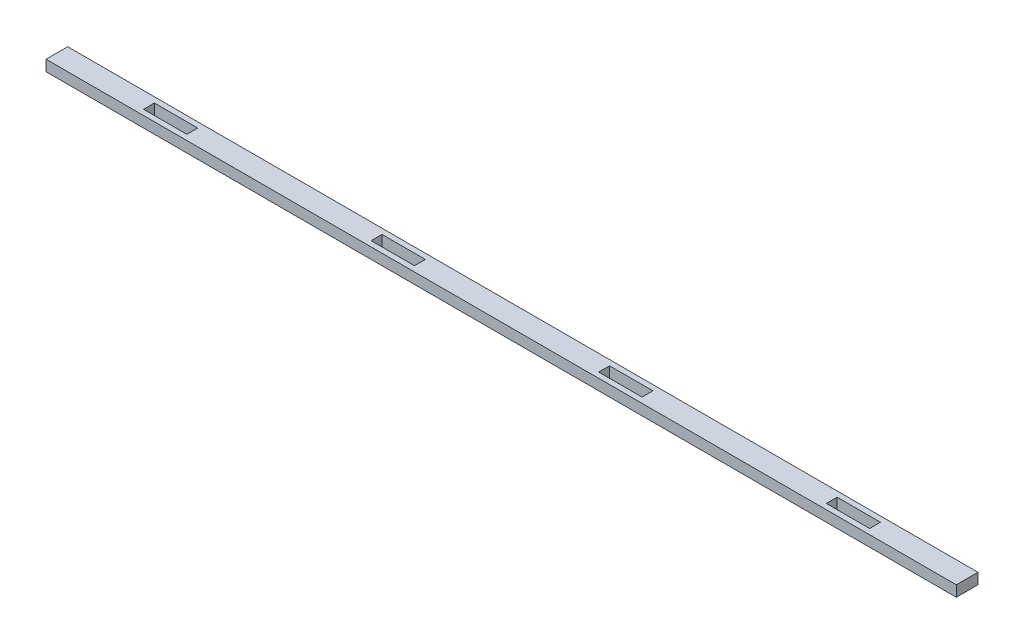
ISO-10303-21;
HEADER;
FILE_DESCRIPTION(('STEP AP214'),'2;1');
FILE_NAME('part.step','',(''),(''),'','','');
FILE_SCHEMA(('AUTOMOTIVE_DESIGN { 1 0 10303 214 1 1 1 1 }'));
ENDSEC;
DATA;
#1=APPLICATION_CONTEXT('core data for automotive mechanical design processes');
#2=APPLICATION_PROTOCOL_DEFINITION('international standard','automotive_design',2000,#1);
#3=PRODUCT_CONTEXT('',#1,'mechanical');
#4=PRODUCT('Part','Part','',(#3));
#5=PRODUCT_RELATED_PRODUCT_CATEGORY('part','',(#4));
#6=PRODUCT_DEFINITION_FORMATION('','',#4);
#7=PRODUCT_DEFINITION_CONTEXT('part definition',#1,'design');
#8=PRODUCT_DEFINITION('design','',#6,#7);
#9=PRODUCT_DEFINITION_SHAPE('','',#8);
#10=(LENGTH_UNIT() NAMED_UNIT(*) SI_UNIT(.MILLI.,.METRE.));
#11=(NAMED_UNIT(*) PLANE_ANGLE_UNIT() SI_UNIT($,.RADIAN.));
#12=(NAMED_UNIT(*) SI_UNIT($,.STERADIAN.) SOLID_ANGLE_UNIT());
#13=UNCERTAINTY_MEASURE_WITH_UNIT(LENGTH_MEASURE(1.E-05),#10,'distance_accuracy_value','');
#14=(GEOMETRIC_REPRESENTATION_CONTEXT(3) GLOBAL_UNCERTAINTY_ASSIGNED_CONTEXT((#13)) GLOBAL_UNIT_ASSIGNED_CONTEXT((#10,
#11,#12)) REPRESENTATION_CONTEXT('',''));
#15=CARTESIAN_POINT('',(0.,0.,0.));
#16=DIRECTION('',(0.,0.,1.));
#17=DIRECTION('',(1.,0.,0.));
#18=AXIS2_PLACEMENT_3D('',#15,#16,#17);
#19=CARTESIAN_POINT('',(187.325,0.,-3.175));
#20=DIRECTION('',(0.,0.,-1.));
#21=DIRECTION('',(-1.,0.,0.));
#22=AXIS2_PLACEMENT_3D('',#19,#20,#21);
#23=PLANE('',#22);
#24=DIRECTION('',(-1.,0.,0.));
#25=VECTOR('',#24,1.);
#26=CARTESIAN_POINT('',(187.325,6.35,-3.175));
#27=LINE('',#26,#25);
#28=CARTESIAN_POINT('',(212.725,6.35,-3.175));
#29=VERTEX_POINT('',#28);
#30=CARTESIAN_POINT('',(187.325,6.35,-3.175));
#31=VERTEX_POINT('',#30);
#32=EDGE_CURVE('E316',#29,#31,#27,.T.);
#33=ORIENTED_EDGE('',*,*,#32,.T.);
#34=DIRECTION('',(0.,1.,0.));
#35=VECTOR('',#34,1.);
#36=CARTESIAN_POINT('',(187.325,0.,-3.175));
#37=LINE('',#36,#35);
#38=CARTESIAN_POINT('',(187.325,0.,-3.175));
#39=VERTEX_POINT('',#38);
#40=EDGE_CURVE('E11',#39,#31,#37,.T.);
#41=ORIENTED_EDGE('',*,*,#40,.F.);
#42=DIRECTION('',(-1.,0.,0.));
#43=VECTOR('',#42,1.);
#44=CARTESIAN_POINT('',(187.325,0.,-3.175));
#45=LINE('',#44,#43);
#46=CARTESIAN_POINT('',(212.725,0.,-3.175));
#47=VERTEX_POINT('',#46);
#48=EDGE_CURVE('E320',#47,#39,#45,.T.);
#49=ORIENTED_EDGE('',*,*,#48,.F.);
#50=DIRECTION('',(0.,1.,0.));
#51=VECTOR('',#50,1.);
#52=CARTESIAN_POINT('',(212.725,0.,-3.175));
#53=LINE('',#52,#51);
#54=EDGE_CURVE('E325',#47,#29,#53,.T.);
#55=ORIENTED_EDGE('',*,*,#54,.T.);
#56=EDGE_LOOP('',(#33,#41,#49,#55));
#57=FACE_BOUND('',#56,.T.);
#58=ADVANCED_FACE('F35',(#57),#23,.F.);
#59=CARTESIAN_POINT('',(187.325,0.,-3.175));
#60=DIRECTION('',(-1.,0.,0.));
#61=DIRECTION('',(0.,0.,1.));
#62=AXIS2_PLACEMENT_3D('',#59,#60,#61);
#63=PLANE('',#62);
#64=DIRECTION('',(0.,0.,1.));
#65=VECTOR('',#64,1.);
#66=CARTESIAN_POINT('',(187.325,6.35,-3.175));
#67=LINE('',#66,#65);
#68=CARTESIAN_POINT('',(187.325,6.35,3.175));
#69=VERTEX_POINT('',#68);
#70=EDGE_CURVE('E313',#31,#69,#67,.T.);
#71=ORIENTED_EDGE('',*,*,#70,.T.);
#72=DIRECTION('',(0.,1.,0.));
#73=VECTOR('',#72,1.);
#74=CARTESIAN_POINT('',(187.325,0.,3.175));
#75=LINE('',#74,#73);
#76=CARTESIAN_POINT('',(187.325,0.,3.175));
#77=VERTEX_POINT('',#76);
#78=EDGE_CURVE('E42',#77,#69,#75,.T.);
#79=ORIENTED_EDGE('',*,*,#78,.F.);
#80=DIRECTION('',(0.,0.,1.));
#81=VECTOR('',#80,1.);
#82=CARTESIAN_POINT('',(187.325,0.,-3.175));
#83=LINE('',#82,#81);
#84=EDGE_CURVE('E56',#39,#77,#83,.T.);
#85=ORIENTED_EDGE('',*,*,#84,.F.);
#86=ORIENTED_EDGE('',*,*,#40,.T.);
#87=EDGE_LOOP('',(#71,#79,#85,#86));
#88=FACE_BOUND('',#87,.T.);
#89=ADVANCED_FACE('F335',(#88),#63,.F.);
#90=CARTESIAN_POINT('',(187.325,0.,3.175));
#91=DIRECTION('',(0.,0.,1.));
#92=DIRECTION('',(1.,0.,0.));
#93=AXIS2_PLACEMENT_3D('',#90,#91,#92);
#94=PLANE('',#93);
#95=DIRECTION('',(1.,0.,0.));
#96=VECTOR('',#95,1.);
#97=CARTESIAN_POINT('',(187.325,6.35,3.175));
#98=LINE('',#97,#96);
#99=CARTESIAN_POINT('',(212.725,6.35,3.175));
#100=VERTEX_POINT('',#99);
#101=EDGE_CURVE('E310',#69,#100,#98,.T.);
#102=ORIENTED_EDGE('',*,*,#101,.T.);
#103=DIRECTION('',(0.,1.,0.));
#104=VECTOR('',#103,1.);
#105=CARTESIAN_POINT('',(212.725,0.,3.175));
#106=LINE('',#105,#104);
#107=CARTESIAN_POINT('',(212.725,0.,3.175));
#108=VERTEX_POINT('',#107);
#109=EDGE_CURVE('E328',#108,#100,#106,.T.);
#110=ORIENTED_EDGE('',*,*,#109,.F.);
#111=DIRECTION('',(1.,0.,0.));
#112=VECTOR('',#111,1.);
#113=CARTESIAN_POINT('',(187.325,0.,3.175));
#114=LINE('',#113,#112);
#115=EDGE_CURVE('E323',#77,#108,#114,.T.);
#116=ORIENTED_EDGE('',*,*,#115,.F.);
#117=ORIENTED_EDGE('',*,*,#78,.T.);
#118=EDGE_LOOP('',(#102,#110,#116,#117));
#119=FACE_BOUND('',#118,.T.);
#120=ADVANCED_FACE('F332',(#119),#94,.F.);
#121=CARTESIAN_POINT('',(212.725,0.,-3.175));
#122=DIRECTION('',(1.,0.,0.));
#123=DIRECTION('',(0.,0.,-1.));
#124=AXIS2_PLACEMENT_3D('',#121,#122,#123);
#125=PLANE('',#124);
#126=DIRECTION('',(0.,0.,-1.));
#127=VECTOR('',#126,1.);
#128=CARTESIAN_POINT('',(212.725,6.35,-3.175));
#129=LINE('',#128,#127);
#130=EDGE_CURVE('E308',#100,#29,#129,.T.);
#131=ORIENTED_EDGE('',*,*,#130,.T.);
#132=ORIENTED_EDGE('',*,*,#54,.F.);
#133=DIRECTION('',(0.,0.,-1.));
#134=VECTOR('',#133,1.);
#135=CARTESIAN_POINT('',(212.725,0.,-3.175));
#136=LINE('',#135,#134);
#137=EDGE_CURVE('E49',#108,#47,#136,.T.);
#138=ORIENTED_EDGE('',*,*,#137,.F.);
#139=ORIENTED_EDGE('',*,*,#109,.T.);
#140=EDGE_LOOP('',(#131,#132,#138,#139));
#141=FACE_BOUND('',#140,.T.);
#142=ADVANCED_FACE('F341',(#141),#125,.F.);
#143=CARTESIAN_POINT('',(53.9750000000001,0.,-3.175));
#144=DIRECTION('',(0.,0.,-1.));
#145=DIRECTION('',(-1.,0.,0.));
#146=AXIS2_PLACEMENT_3D('',#143,#144,#145);
#147=PLANE('',#146);
#148=DIRECTION('',(-1.,0.,0.));
#149=VECTOR('',#148,1.);
#150=CARTESIAN_POINT('',(53.9750000000001,6.35,-3.175));
#151=LINE('',#150,#149);
#152=CARTESIAN_POINT('',(79.3750000000001,6.35,-3.175));
#153=VERTEX_POINT('',#152);
#154=CARTESIAN_POINT('',(53.9750000000001,6.35,-3.175));
#155=VERTEX_POINT('',#154);
#156=EDGE_CURVE('E284',#153,#155,#151,.T.);
#157=ORIENTED_EDGE('',*,*,#156,.T.);
#158=DIRECTION('',(0.,1.,0.));
#159=VECTOR('',#158,1.);
#160=CARTESIAN_POINT('',(53.9750000000001,0.,-3.175));
#161=LINE('',#160,#159);
#162=CARTESIAN_POINT('',(53.9750000000001,0.,-3.175));
#163=VERTEX_POINT('',#162);
#164=EDGE_CURVE('E305',#163,#155,#161,.T.);
#165=ORIENTED_EDGE('',*,*,#164,.F.);
#166=DIRECTION('',(-1.,0.,0.));
#167=VECTOR('',#166,1.);
#168=CARTESIAN_POINT('',(53.9750000000001,0.,-3.175));
#169=LINE('',#168,#167);
#170=CARTESIAN_POINT('',(79.3750000000001,0.,-3.175));
#171=VERTEX_POINT('',#170);
#172=EDGE_CURVE('E289',#171,#163,#169,.T.);
#173=ORIENTED_EDGE('',*,*,#172,.F.);
#174=DIRECTION('',(0.,1.,0.));
#175=VECTOR('',#174,1.);
#176=CARTESIAN_POINT('',(79.3750000000001,0.,-3.175));
#177=LINE('',#176,#175);
#178=EDGE_CURVE('E296',#171,#153,#177,.T.);
#179=ORIENTED_EDGE('',*,*,#178,.T.);
#180=EDGE_LOOP('',(#157,#165,#173,#179));
#181=FACE_BOUND('',#180,.T.);
#182=ADVANCED_FACE('F343',(#181),#147,.F.);
#183=CARTESIAN_POINT('',(53.9750000000001,0.,-3.175));
#184=DIRECTION('',(-1.,0.,0.));
#185=DIRECTION('',(0.,0.,1.));
#186=AXIS2_PLACEMENT_3D('',#183,#184,#185);
#187=PLANE('',#186);
#188=DIRECTION('',(0.,0.,1.));
#189=VECTOR('',#188,1.);
#190=CARTESIAN_POINT('',(53.9750000000001,6.35,-3.175));
#191=LINE('',#190,#189);
#192=CARTESIAN_POINT('',(53.9750000000001,6.35,3.175));
#193=VERTEX_POINT('',#192);
#194=EDGE_CURVE('E281',#155,#193,#191,.T.);
#195=ORIENTED_EDGE('',*,*,#194,.T.);
#196=DIRECTION('',(0.,1.,0.));
#197=VECTOR('',#196,1.);
#198=CARTESIAN_POINT('',(53.9750000000001,0.,3.175));
#199=LINE('',#198,#197);
#200=CARTESIAN_POINT('',(53.9750000000001,0.,3.175));
#201=VERTEX_POINT('',#200);
#202=EDGE_CURVE('E302',#201,#193,#199,.T.);
#203=ORIENTED_EDGE('',*,*,#202,.F.);
#204=DIRECTION('',(0.,0.,1.));
#205=VECTOR('',#204,1.);
#206=CARTESIAN_POINT('',(53.9750000000001,0.,-3.175));
#207=LINE('',#206,#205);
#208=EDGE_CURVE('E291',#163,#201,#207,.T.);
#209=ORIENTED_EDGE('',*,*,#208,.F.);
#210=ORIENTED_EDGE('',*,*,#164,.T.);
#211=EDGE_LOOP('',(#195,#203,#209,#210));
#212=FACE_BOUND('',#211,.T.);
#213=ADVANCED_FACE('F349',(#212),#187,.F.);
#214=CARTESIAN_POINT('',(53.9750000000001,0.,3.175));
#215=DIRECTION('',(0.,0.,1.));
#216=DIRECTION('',(1.,0.,0.));
#217=AXIS2_PLACEMENT_3D('',#214,#215,#216);
#218=PLANE('',#217);
#219=DIRECTION('',(1.,0.,0.));
#220=VECTOR('',#219,1.);
#221=CARTESIAN_POINT('',(53.9750000000001,6.35,3.175));
#222=LINE('',#221,#220);
#223=CARTESIAN_POINT('',(79.3750000000001,6.35,3.175));
#224=VERTEX_POINT('',#223);
#225=EDGE_CURVE('E278',#193,#224,#222,.T.);
#226=ORIENTED_EDGE('',*,*,#225,.T.);
#227=DIRECTION('',(0.,1.,0.));
#228=VECTOR('',#227,1.);
#229=CARTESIAN_POINT('',(79.3750000000001,0.,3.175));
#230=LINE('',#229,#228);
#231=CARTESIAN_POINT('',(79.3750000000001,0.,3.175));
#232=VERTEX_POINT('',#231);
#233=EDGE_CURVE('E299',#232,#224,#230,.T.);
#234=ORIENTED_EDGE('',*,*,#233,.F.);
#235=DIRECTION('',(1.,0.,0.));
#236=VECTOR('',#235,1.);
#237=CARTESIAN_POINT('',(53.9750000000001,0.,3.175));
#238=LINE('',#237,#236);
#239=EDGE_CURVE('E293',#201,#232,#238,.T.);
#240=ORIENTED_EDGE('',*,*,#239,.F.);
#241=ORIENTED_EDGE('',*,*,#202,.T.);
#242=EDGE_LOOP('',(#226,#234,#240,#241));
#243=FACE_BOUND('',#242,.T.);
#244=ADVANCED_FACE('F382',(#243),#218,.F.);
#245=CARTESIAN_POINT('',(79.3750000000001,0.,-3.175));
#246=DIRECTION('',(1.,0.,0.));
#247=DIRECTION('',(0.,0.,-1.));
#248=AXIS2_PLACEMENT_3D('',#245,#246,#247);
#249=PLANE('',#248);
#250=DIRECTION('',(0.,0.,-1.));
#251=VECTOR('',#250,1.);
#252=CARTESIAN_POINT('',(79.3750000000001,6.35,-3.175));
#253=LINE('',#252,#251);
#254=EDGE_CURVE('E276',#224,#153,#253,.T.);
#255=ORIENTED_EDGE('',*,*,#254,.T.);
#256=ORIENTED_EDGE('',*,*,#178,.F.);
#257=DIRECTION('',(0.,0.,-1.));
#258=VECTOR('',#257,1.);
#259=CARTESIAN_POINT('',(79.3750000000001,0.,-3.175));
#260=LINE('',#259,#258);
#261=EDGE_CURVE('E287',#232,#171,#260,.T.);
#262=ORIENTED_EDGE('',*,*,#261,.F.);
#263=ORIENTED_EDGE('',*,*,#233,.T.);
#264=EDGE_LOOP('',(#255,#256,#262,#263));
#265=FACE_BOUND('',#264,.T.);
#266=ADVANCED_FACE('F392',(#265),#249,.F.);
#267=CARTESIAN_POINT('',(266.7,6.35,-6.34999999999999));
#268=DIRECTION('',(-1.,0.,0.));
#269=DIRECTION('',(0.,0.,1.));
#270=AXIS2_PLACEMENT_3D('',#267,#268,#269);
#271=PLANE('',#270);
#272=DIRECTION('',(0.,0.,-1.));
#273=VECTOR('',#272,1.);
#274=CARTESIAN_POINT('',(266.7,0.,-6.34999999999999));
#275=LINE('',#274,#273);
#276=CARTESIAN_POINT('',(266.7,0.,6.35));
#277=VERTEX_POINT('',#276);
#278=CARTESIAN_POINT('',(266.7,0.,-6.34999999999999));
#279=VERTEX_POINT('',#278);
#280=EDGE_CURVE('E240',#277,#279,#275,.T.);
#281=ORIENTED_EDGE('',*,*,#280,.T.);
#282=DIRECTION('',(0.,-1.,0.));
#283=VECTOR('',#282,1.);
#284=CARTESIAN_POINT('',(266.7,6.35,-6.34999999999999));
#285=LINE('',#284,#283);
#286=CARTESIAN_POINT('',(266.7,6.35,-6.34999999999999));
#287=VERTEX_POINT('',#286);
#288=EDGE_CURVE('E273',#287,#279,#285,.T.);
#289=ORIENTED_EDGE('',*,*,#288,.F.);
#290=DIRECTION('',(0.,0.,-1.));
#291=VECTOR('',#290,1.);
#292=CARTESIAN_POINT('',(266.7,6.35,-6.34999999999999));
#293=LINE('',#292,#291);
#294=CARTESIAN_POINT('',(266.7,6.35,6.35));
#295=VERTEX_POINT('',#294);
#296=EDGE_CURVE('E247',#295,#287,#293,.T.);
#297=ORIENTED_EDGE('',*,*,#296,.F.);
#298=DIRECTION('',(0.,-1.,0.));
#299=VECTOR('',#298,1.);
#300=CARTESIAN_POINT('',(266.7,6.35,6.35));
#301=LINE('',#300,#299);
#302=EDGE_CURVE('E257',#295,#277,#301,.T.);
#303=ORIENTED_EDGE('',*,*,#302,.T.);
#304=EDGE_LOOP('',(#281,#289,#297,#303));
#305=FACE_BOUND('',#304,.T.);
#306=ADVANCED_FACE('F402',(#305),#271,.F.);
#307=CARTESIAN_POINT('',(-266.7,6.35,-6.34999999999999));
#308=DIRECTION('',(0.,0.,1.));
#309=DIRECTION('',(1.,0.,0.));
#310=AXIS2_PLACEMENT_3D('',#307,#308,#309);
#311=PLANE('',#310);
#312=DIRECTION('',(-1.,0.,0.));
#313=VECTOR('',#312,1.);
#314=CARTESIAN_POINT('',(-266.7,0.,-6.34999999999999));
#315=LINE('',#314,#313);
#316=CARTESIAN_POINT('',(-266.7,0.,-6.34999999999999));
#317=VERTEX_POINT('',#316);
#318=EDGE_CURVE('E260',#279,#317,#315,.T.);
#319=ORIENTED_EDGE('',*,*,#318,.T.);
#320=DIRECTION('',(0.,-1.,0.));
#321=VECTOR('',#320,1.);
#322=CARTESIAN_POINT('',(-266.7,6.35,-6.34999999999999));
#323=LINE('',#322,#321);
#324=CARTESIAN_POINT('',(-266.7,6.35,-6.34999999999999));
#325=VERTEX_POINT('',#324);
#326=EDGE_CURVE('E270',#325,#317,#323,.T.);
#327=ORIENTED_EDGE('',*,*,#326,.F.);
#328=DIRECTION('',(-1.,0.,0.));
#329=VECTOR('',#328,1.);
#330=CARTESIAN_POINT('',(-266.7,6.35,-6.34999999999999));
#331=LINE('',#330,#329);
#332=EDGE_CURVE('E250',#287,#325,#331,.T.);
#333=ORIENTED_EDGE('',*,*,#332,.F.);
#334=ORIENTED_EDGE('',*,*,#288,.T.);
#335=EDGE_LOOP('',(#319,#327,#333,#334));
#336=FACE_BOUND('',#335,.T.);
#337=ADVANCED_FACE('F488',(#336),#311,.F.);
#338=CARTESIAN_POINT('',(-266.7,6.35,-6.34999999999999));
#339=DIRECTION('',(1.,0.,0.));
#340=DIRECTION('',(0.,0.,-1.));
#341=AXIS2_PLACEMENT_3D('',#338,#339,#340);
#342=PLANE('',#341);
#343=DIRECTION('',(0.,0.,1.));
#344=VECTOR('',#343,1.);
#345=CARTESIAN_POINT('',(-266.7,0.,-6.34999999999999));
#346=LINE('',#345,#344);
#347=CARTESIAN_POINT('',(-266.7,0.,6.35));
#348=VERTEX_POINT('',#347);
#349=EDGE_CURVE('E262',#317,#348,#346,.T.);
#350=ORIENTED_EDGE('',*,*,#349,.T.);
#351=DIRECTION('',(0.,-1.,0.));
#352=VECTOR('',#351,1.);
#353=CARTESIAN_POINT('',(-266.7,6.35,6.35));
#354=LINE('',#353,#352);
#355=CARTESIAN_POINT('',(-266.7,6.35,6.35));
#356=VERTEX_POINT('',#355);
#357=EDGE_CURVE('E267',#356,#348,#354,.T.);
#358=ORIENTED_EDGE('',*,*,#357,.F.);
#359=DIRECTION('',(0.,0.,1.));
#360=VECTOR('',#359,1.);
#361=CARTESIAN_POINT('',(-266.7,6.35,-6.34999999999999));
#362=LINE('',#361,#360);
#363=EDGE_CURVE('E253',#325,#356,#362,.T.);
#364=ORIENTED_EDGE('',*,*,#363,.F.);
#365=ORIENTED_EDGE('',*,*,#326,.T.);
#366=EDGE_LOOP('',(#350,#358,#364,#365));
#367=FACE_BOUND('',#366,.T.);
#368=ADVANCED_FACE('F484',(#367),#342,.F.);
#369=CARTESIAN_POINT('',(-266.7,6.35,6.35));
#370=DIRECTION('',(0.,0.,-1.));
#371=DIRECTION('',(-1.,0.,0.));
#372=AXIS2_PLACEMENT_3D('',#369,#370,#371);
#373=PLANE('',#372);
#374=DIRECTION('',(1.,0.,0.));
#375=VECTOR('',#374,1.);
#376=CARTESIAN_POINT('',(-266.7,0.,6.35));
#377=LINE('',#376,#375);
#378=EDGE_CURVE('E251',#348,#277,#377,.T.);
#379=ORIENTED_EDGE('',*,*,#378,.T.);
#380=ORIENTED_EDGE('',*,*,#302,.F.);
#381=DIRECTION('',(1.,0.,0.));
#382=VECTOR('',#381,1.);
#383=CARTESIAN_POINT('',(-266.7,6.35,6.35));
#384=LINE('',#383,#382);
#385=EDGE_CURVE('E255',#356,#295,#384,.T.);
#386=ORIENTED_EDGE('',*,*,#385,.F.);
#387=ORIENTED_EDGE('',*,*,#357,.T.);
#388=EDGE_LOOP('',(#379,#380,#386,#387));
#389=FACE_BOUND('',#388,.T.);
#390=ADVANCED_FACE('F415',(#389),#373,.F.);
#391=CARTESIAN_POINT('',(0.,6.35,0.));
#392=DIRECTION('',(0.,1.,0.));
#393=DIRECTION('',(0.,0.,1.));
#394=AXIS2_PLACEMENT_3D('',#391,#392,#393);
#395=PLANE('',#394);
#396=DIRECTION('',(0.,0.,-1.));
#397=VECTOR('',#396,1.);
#398=CARTESIAN_POINT('',(-53.9749999999999,6.35,-3.175));
#399=LINE('',#398,#397);
#400=CARTESIAN_POINT('',(-53.9749999999999,6.35,3.175));
#401=VERTEX_POINT('',#400);
#402=CARTESIAN_POINT('',(-53.9749999999999,6.35,-3.175));
#403=VERTEX_POINT('',#402);
#404=EDGE_CURVE('E209',#401,#403,#399,.T.);
#405=ORIENTED_EDGE('',*,*,#404,.F.);
#406=DIRECTION('',(1.,0.,0.));
#407=VECTOR('',#406,1.);
#408=CARTESIAN_POINT('',(-79.3749999999999,6.35,3.175));
#409=LINE('',#408,#407);
#410=CARTESIAN_POINT('',(-79.3749999999999,6.35,3.175));
#411=VERTEX_POINT('',#410);
#412=EDGE_CURVE('E195',#411,#401,#409,.T.);
#413=ORIENTED_EDGE('',*,*,#412,.F.);
#414=DIRECTION('',(0.,0.,1.));
#415=VECTOR('',#414,1.);
#416=CARTESIAN_POINT('',(-79.3749999999999,6.35,-3.175));
#417=LINE('',#416,#415);
#418=CARTESIAN_POINT('',(-79.3749999999999,6.35,-3.175));
#419=VERTEX_POINT('',#418);
#420=EDGE_CURVE('E187',#419,#411,#417,.T.);
#421=ORIENTED_EDGE('',*,*,#420,.F.);
#422=DIRECTION('',(-1.,0.,0.));
#423=VECTOR('',#422,1.);
#424=CARTESIAN_POINT('',(-79.3749999999999,6.35,-3.175));
#425=LINE('',#424,#423);
#426=EDGE_CURVE('E173',#403,#419,#425,.T.);
#427=ORIENTED_EDGE('',*,*,#426,.F.);
#428=EDGE_LOOP('',(#405,#413,#421,#427));
#429=FACE_BOUND('',#428,.T.);
#430=DIRECTION('',(0.,0.,-1.));
#431=VECTOR('',#430,1.);
#432=CARTESIAN_POINT('',(-187.325,6.35,-3.175));
#433=LINE('',#432,#431);
#434=CARTESIAN_POINT('',(-187.325,6.35,3.175));
#435=VERTEX_POINT('',#434);
#436=CARTESIAN_POINT('',(-187.325,6.35,-3.175));
#437=VERTEX_POINT('',#436);
#438=EDGE_CURVE('E214',#435,#437,#433,.T.);
#439=ORIENTED_EDGE('',*,*,#438,.F.);
#440=DIRECTION('',(1.,0.,0.));
#441=VECTOR('',#440,1.);
#442=CARTESIAN_POINT('',(-212.725,6.35,3.175));
#443=LINE('',#442,#441);
#444=CARTESIAN_POINT('',(-212.725,6.35,3.175));
#445=VERTEX_POINT('',#444);
#446=EDGE_CURVE('E219',#445,#435,#443,.T.);
#447=ORIENTED_EDGE('',*,*,#446,.F.);
#448=DIRECTION('',(0.,0.,1.));
#449=VECTOR('',#448,1.);
#450=CARTESIAN_POINT('',(-212.725,6.35,-3.175));
#451=LINE('',#450,#449);
#452=CARTESIAN_POINT('',(-212.725,6.35,-3.175));
#453=VERTEX_POINT('',#452);
#454=EDGE_CURVE('E233',#453,#445,#451,.T.);
#455=ORIENTED_EDGE('',*,*,#454,.F.);
#456=DIRECTION('',(-1.,0.,0.));
#457=VECTOR('',#456,1.);
#458=CARTESIAN_POINT('',(-212.725,6.35,-3.175));
#459=LINE('',#458,#457);
#460=EDGE_CURVE('E230',#437,#453,#459,.T.);
#461=ORIENTED_EDGE('',*,*,#460,.F.);
#462=EDGE_LOOP('',(#439,#447,#455,#461));
#463=FACE_BOUND('',#462,.T.);
#464=ORIENTED_EDGE('',*,*,#296,.T.);
#465=ORIENTED_EDGE('',*,*,#332,.T.);
#466=ORIENTED_EDGE('',*,*,#363,.T.);
#467=ORIENTED_EDGE('',*,*,#385,.T.);
#468=EDGE_LOOP('',(#464,#465,#466,#467));
#469=FACE_BOUND('',#468,.T.);
#470=ORIENTED_EDGE('',*,*,#254,.F.);
#471=ORIENTED_EDGE('',*,*,#225,.F.);
#472=ORIENTED_EDGE('',*,*,#194,.F.);
#473=ORIENTED_EDGE('',*,*,#156,.F.);
#474=EDGE_LOOP('',(#470,#471,#472,#473));
#475=FACE_BOUND('',#474,.T.);
#476=ORIENTED_EDGE('',*,*,#130,.F.);
#477=ORIENTED_EDGE('',*,*,#101,.F.);
#478=ORIENTED_EDGE('',*,*,#70,.F.);
#479=ORIENTED_EDGE('',*,*,#32,.F.);
#480=EDGE_LOOP('',(#476,#477,#478,#479));
#481=FACE_BOUND('',#480,.T.);
#482=ADVANCED_FACE('F193',(#429,#463,#469,#475,#481),#395,.T.);
#483=CARTESIAN_POINT('',(0.,0.,0.));
#484=DIRECTION('',(0.,1.,0.));
#485=DIRECTION('',(0.,0.,1.));
#486=AXIS2_PLACEMENT_3D('',#483,#484,#485);
#487=PLANE('',#486);
#488=DIRECTION('',(1.,0.,0.));
#489=VECTOR('',#488,1.);
#490=CARTESIAN_POINT('',(-79.3749999999999,0.,3.175));
#491=LINE('',#490,#489);
#492=CARTESIAN_POINT('',(-79.3749999999999,0.,3.175));
#493=VERTEX_POINT('',#492);
#494=CARTESIAN_POINT('',(-53.9749999999999,0.,3.175));
#495=VERTEX_POINT('',#494);
#496=EDGE_CURVE('E206',#493,#495,#491,.T.);
#497=ORIENTED_EDGE('',*,*,#496,.T.);
#498=DIRECTION('',(0.,0.,-1.));
#499=VECTOR('',#498,1.);
#500=CARTESIAN_POINT('',(-53.9749999999999,0.,-3.175));
#501=LINE('',#500,#499);
#502=CARTESIAN_POINT('',(-53.9749999999999,0.,-3.175));
#503=VERTEX_POINT('',#502);
#504=EDGE_CURVE('E211',#495,#503,#501,.T.);
#505=ORIENTED_EDGE('',*,*,#504,.T.);
#506=DIRECTION('',(-1.,0.,0.));
#507=VECTOR('',#506,1.);
#508=CARTESIAN_POINT('',(-79.3749999999999,0.,-3.175));
#509=LINE('',#508,#507);
#510=CARTESIAN_POINT('',(-79.3749999999999,0.,-3.175));
#511=VERTEX_POINT('',#510);
#512=EDGE_CURVE('E183',#503,#511,#509,.T.);
#513=ORIENTED_EDGE('',*,*,#512,.T.);
#514=DIRECTION('',(0.,0.,1.));
#515=VECTOR('',#514,1.);
#516=CARTESIAN_POINT('',(-79.3749999999999,0.,-3.175));
#517=LINE('',#516,#515);
#518=EDGE_CURVE('E190',#511,#493,#517,.T.);
#519=ORIENTED_EDGE('',*,*,#518,.T.);
#520=EDGE_LOOP('',(#497,#505,#513,#519));
#521=FACE_BOUND('',#520,.T.);
#522=DIRECTION('',(1.,0.,0.));
#523=VECTOR('',#522,1.);
#524=CARTESIAN_POINT('',(-212.725,0.,3.175));
#525=LINE('',#524,#523);
#526=CARTESIAN_POINT('',(-212.725,0.,3.175));
#527=VERTEX_POINT('',#526);
#528=CARTESIAN_POINT('',(-187.325,0.,3.175));
#529=VERTEX_POINT('',#528);
#530=EDGE_CURVE('E225',#527,#529,#525,.T.);
#531=ORIENTED_EDGE('',*,*,#530,.T.);
#532=DIRECTION('',(0.,0.,-1.));
#533=VECTOR('',#532,1.);
#534=CARTESIAN_POINT('',(-187.325,0.,-3.175));
#535=LINE('',#534,#533);
#536=CARTESIAN_POINT('',(-187.325,0.,-3.175));
#537=VERTEX_POINT('',#536);
#538=EDGE_CURVE('E215',#529,#537,#535,.T.);
#539=ORIENTED_EDGE('',*,*,#538,.T.);
#540=DIRECTION('',(-1.,0.,0.));
#541=VECTOR('',#540,1.);
#542=CARTESIAN_POINT('',(-212.725,0.,-3.175));
#543=LINE('',#542,#541);
#544=CARTESIAN_POINT('',(-212.725,0.,-3.175));
#545=VERTEX_POINT('',#544);
#546=EDGE_CURVE('E218',#537,#545,#543,.T.);
#547=ORIENTED_EDGE('',*,*,#546,.T.);
#548=DIRECTION('',(0.,0.,1.));
#549=VECTOR('',#548,1.);
#550=CARTESIAN_POINT('',(-212.725,0.,-3.175));
#551=LINE('',#550,#549);
#552=EDGE_CURVE('E222',#545,#527,#551,.T.);
#553=ORIENTED_EDGE('',*,*,#552,.T.);
#554=EDGE_LOOP('',(#531,#539,#547,#553));
#555=FACE_BOUND('',#554,.T.);
#556=ORIENTED_EDGE('',*,*,#280,.F.);
#557=ORIENTED_EDGE('',*,*,#378,.F.);
#558=ORIENTED_EDGE('',*,*,#349,.F.);
#559=ORIENTED_EDGE('',*,*,#318,.F.);
#560=EDGE_LOOP('',(#556,#557,#558,#559));
#561=FACE_BOUND('',#560,.T.);
#562=ORIENTED_EDGE('',*,*,#261,.T.);
#563=ORIENTED_EDGE('',*,*,#172,.T.);
#564=ORIENTED_EDGE('',*,*,#208,.T.);
#565=ORIENTED_EDGE('',*,*,#239,.T.);
#566=EDGE_LOOP('',(#562,#563,#564,#565));
#567=FACE_BOUND('',#566,.T.);
#568=ORIENTED_EDGE('',*,*,#137,.T.);
#569=ORIENTED_EDGE('',*,*,#48,.T.);
#570=ORIENTED_EDGE('',*,*,#84,.T.);
#571=ORIENTED_EDGE('',*,*,#115,.T.);
#572=EDGE_LOOP('',(#568,#569,#570,#571));
#573=FACE_BOUND('',#572,.T.);
#574=ADVANCED_FACE('F414',(#521,#555,#561,#567,#573),#487,.F.);
#575=CARTESIAN_POINT('',(-187.325,0.,-3.175));
#576=DIRECTION('',(1.,0.,0.));
#577=DIRECTION('',(0.,0.,-1.));
#578=AXIS2_PLACEMENT_3D('',#575,#576,#577);
#579=PLANE('',#578);
#580=ORIENTED_EDGE('',*,*,#438,.T.);
#581=DIRECTION('',(0.,1.,0.));
#582=VECTOR('',#581,1.);
#583=CARTESIAN_POINT('',(-187.325,0.,-3.175));
#584=LINE('',#583,#582);
#585=EDGE_CURVE('E228',#537,#437,#584,.T.);
#586=ORIENTED_EDGE('',*,*,#585,.F.);
#587=ORIENTED_EDGE('',*,*,#538,.F.);
#588=DIRECTION('',(0.,1.,0.));
#589=VECTOR('',#588,1.);
#590=CARTESIAN_POINT('',(-187.325,0.,3.175));
#591=LINE('',#590,#589);
#592=EDGE_CURVE('E238',#529,#435,#591,.T.);
#593=ORIENTED_EDGE('',*,*,#592,.T.);
#594=EDGE_LOOP('',(#580,#586,#587,#593));
#595=FACE_BOUND('',#594,.T.);
#596=ADVANCED_FACE('F426',(#595),#579,.F.);
#597=CARTESIAN_POINT('',(-212.725,0.,3.175));
#598=DIRECTION('',(0.,0.,1.));
#599=DIRECTION('',(1.,0.,0.));
#600=AXIS2_PLACEMENT_3D('',#597,#598,#599);
#601=PLANE('',#600);
#602=ORIENTED_EDGE('',*,*,#446,.T.);
#603=ORIENTED_EDGE('',*,*,#592,.F.);
#604=ORIENTED_EDGE('',*,*,#530,.F.);
#605=DIRECTION('',(0.,1.,0.));
#606=VECTOR('',#605,1.);
#607=CARTESIAN_POINT('',(-212.725,0.,3.175));
#608=LINE('',#607,#606);
#609=EDGE_CURVE('E241',#527,#445,#608,.T.);
#610=ORIENTED_EDGE('',*,*,#609,.T.);
#611=EDGE_LOOP('',(#602,#603,#604,#610));
#612=FACE_BOUND('',#611,.T.);
#613=ADVANCED_FACE('F471',(#612),#601,.F.);
#614=CARTESIAN_POINT('',(-212.725,0.,-3.175));
#615=DIRECTION('',(-1.,0.,0.));
#616=DIRECTION('',(0.,0.,1.));
#617=AXIS2_PLACEMENT_3D('',#614,#615,#616);
#618=PLANE('',#617);
#619=ORIENTED_EDGE('',*,*,#454,.T.);
#620=ORIENTED_EDGE('',*,*,#609,.F.);
#621=ORIENTED_EDGE('',*,*,#552,.F.);
#622=DIRECTION('',(0.,1.,0.));
#623=VECTOR('',#622,1.);
#624=CARTESIAN_POINT('',(-212.725,0.,-3.175));
#625=LINE('',#624,#623);
#626=EDGE_CURVE('E243',#545,#453,#625,.T.);
#627=ORIENTED_EDGE('',*,*,#626,.T.);
#628=EDGE_LOOP('',(#619,#620,#621,#627));
#629=FACE_BOUND('',#628,.T.);
#630=ADVANCED_FACE('F474',(#629),#618,.F.);
#631=CARTESIAN_POINT('',(-212.725,0.,-3.175));
#632=DIRECTION('',(0.,0.,-1.));
#633=DIRECTION('',(-1.,0.,0.));
#634=AXIS2_PLACEMENT_3D('',#631,#632,#633);
#635=PLANE('',#634);
#636=ORIENTED_EDGE('',*,*,#460,.T.);
#637=ORIENTED_EDGE('',*,*,#626,.F.);
#638=ORIENTED_EDGE('',*,*,#546,.F.);
#639=ORIENTED_EDGE('',*,*,#585,.T.);
#640=EDGE_LOOP('',(#636,#637,#638,#639));
#641=FACE_BOUND('',#640,.T.);
#642=ADVANCED_FACE('F439',(#641),#635,.F.);
#643=CARTESIAN_POINT('',(-53.9749999999999,0.,-3.175));
#644=DIRECTION('',(1.,0.,0.));
#645=DIRECTION('',(0.,0.,-1.));
#646=AXIS2_PLACEMENT_3D('',#643,#644,#645);
#647=PLANE('',#646);
#648=ORIENTED_EDGE('',*,*,#404,.T.);
#649=DIRECTION('',(0.,1.,0.));
#650=VECTOR('',#649,1.);
#651=CARTESIAN_POINT('',(-53.9749999999999,0.,-3.175));
#652=LINE('',#651,#650);
#653=EDGE_CURVE('E179',#503,#403,#652,.T.);
#654=ORIENTED_EDGE('',*,*,#653,.F.);
#655=ORIENTED_EDGE('',*,*,#504,.F.);
#656=DIRECTION('',(0.,1.,0.));
#657=VECTOR('',#656,1.);
#658=CARTESIAN_POINT('',(-53.9749999999999,0.,3.175));
#659=LINE('',#658,#657);
#660=EDGE_CURVE('E203',#495,#401,#659,.T.);
#661=ORIENTED_EDGE('',*,*,#660,.T.);
#662=EDGE_LOOP('',(#648,#654,#655,#661));
#663=FACE_BOUND('',#662,.T.);
#664=ADVANCED_FACE('F434',(#663),#647,.F.);
#665=CARTESIAN_POINT('',(-79.3749999999999,0.,3.175));
#666=DIRECTION('',(0.,0.,1.));
#667=DIRECTION('',(1.,0.,0.));
#668=AXIS2_PLACEMENT_3D('',#665,#666,#667);
#669=PLANE('',#668);
#670=ORIENTED_EDGE('',*,*,#412,.T.);
#671=ORIENTED_EDGE('',*,*,#660,.F.);
#672=ORIENTED_EDGE('',*,*,#496,.F.);
#673=DIRECTION('',(0.,1.,0.));
#674=VECTOR('',#673,1.);
#675=CARTESIAN_POINT('',(-79.3749999999999,0.,3.175));
#676=LINE('',#675,#674);
#677=EDGE_CURVE('E196',#493,#411,#676,.T.);
#678=ORIENTED_EDGE('',*,*,#677,.T.);
#679=EDGE_LOOP('',(#670,#671,#672,#678));
#680=FACE_BOUND('',#679,.T.);
#681=ADVANCED_FACE('F438',(#680),#669,.F.);
#682=CARTESIAN_POINT('',(-79.3749999999999,0.,-3.175));
#683=DIRECTION('',(-1.,0.,0.));
#684=DIRECTION('',(0.,0.,1.));
#685=AXIS2_PLACEMENT_3D('',#682,#683,#684);
#686=PLANE('',#685);
#687=ORIENTED_EDGE('',*,*,#420,.T.);
#688=ORIENTED_EDGE('',*,*,#677,.F.);
#689=ORIENTED_EDGE('',*,*,#518,.F.);
#690=DIRECTION('',(0.,1.,0.));
#691=VECTOR('',#690,1.);
#692=CARTESIAN_POINT('',(-79.3749999999999,0.,-3.175));
#693=LINE('',#692,#691);
#694=EDGE_CURVE('E176',#511,#419,#693,.T.);
#695=ORIENTED_EDGE('',*,*,#694,.T.);
#696=EDGE_LOOP('',(#687,#688,#689,#695));
#697=FACE_BOUND('',#696,.T.);
#698=ADVANCED_FACE('F186',(#697),#686,.F.);
#699=CARTESIAN_POINT('',(-79.3749999999999,0.,-3.175));
#700=DIRECTION('',(0.,0.,-1.));
#701=DIRECTION('',(-1.,0.,0.));
#702=AXIS2_PLACEMENT_3D('',#699,#700,#701);
#703=PLANE('',#702);
#704=ORIENTED_EDGE('',*,*,#426,.T.);
#705=ORIENTED_EDGE('',*,*,#694,.F.);
#706=ORIENTED_EDGE('',*,*,#512,.F.);
#707=ORIENTED_EDGE('',*,*,#653,.T.);
#708=EDGE_LOOP('',(#704,#705,#706,#707));
#709=FACE_BOUND('',#708,.T.);
#710=ADVANCED_FACE('F175',(#709),#703,.F.);
#711=CLOSED_SHELL('',(#58,#89,#120,#142,#182,#213,#244,#266,#306,#337,#368,#390,#482,#574,#596,
#613,#630,#642,#664,#681,#698,#710));
#712=MANIFOLD_SOLID_BREP('B2',#711);
#713=ADVANCED_BREP_SHAPE_REPRESENTATION('',(#18,#712),#14);
#714=SHAPE_DEFINITION_REPRESENTATION(#9,#713);
ENDSEC;
END-ISO-10303-21;
